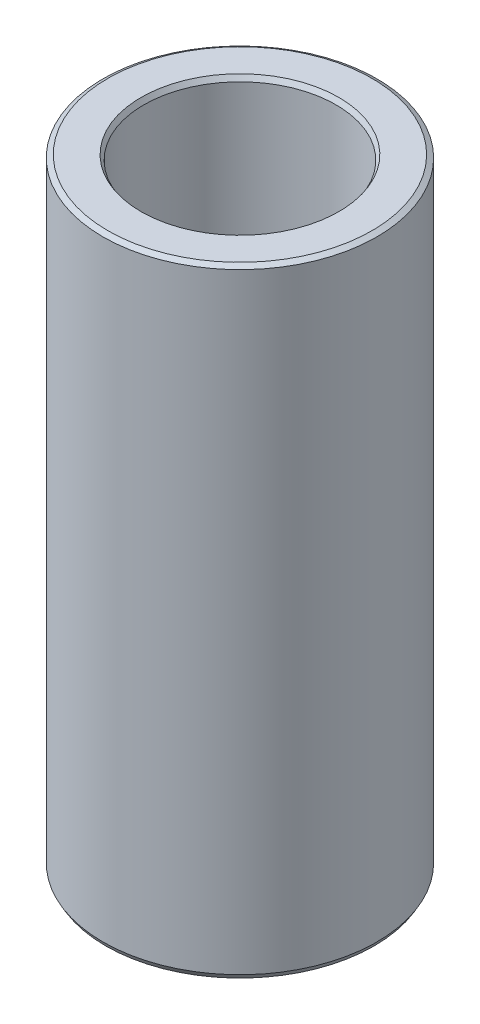
ISO-10303-21;
HEADER;
FILE_DESCRIPTION(('STEP AP214'),'2;1');
FILE_NAME('part.step','',(''),(''),'','','');
FILE_SCHEMA(('AUTOMOTIVE_DESIGN { 1 0 10303 214 1 1 1 1 }'));
ENDSEC;
DATA;
#1=APPLICATION_CONTEXT('core data for automotive mechanical design processes');
#2=APPLICATION_PROTOCOL_DEFINITION('international standard','automotive_design',2000,#1);
#3=PRODUCT_CONTEXT('',#1,'mechanical');
#4=PRODUCT('Part','Part','',(#3));
#5=PRODUCT_RELATED_PRODUCT_CATEGORY('part','',(#4));
#6=PRODUCT_DEFINITION_FORMATION('','',#4);
#7=PRODUCT_DEFINITION_CONTEXT('part definition',#1,'design');
#8=PRODUCT_DEFINITION('design','',#6,#7);
#9=PRODUCT_DEFINITION_SHAPE('','',#8);
#10=(LENGTH_UNIT() NAMED_UNIT(*) SI_UNIT(.MILLI.,.METRE.));
#11=(NAMED_UNIT(*) PLANE_ANGLE_UNIT() SI_UNIT($,.RADIAN.));
#12=(NAMED_UNIT(*) SI_UNIT($,.STERADIAN.) SOLID_ANGLE_UNIT());
#13=UNCERTAINTY_MEASURE_WITH_UNIT(LENGTH_MEASURE(1.E-05),#10,'distance_accuracy_value','');
#14=(GEOMETRIC_REPRESENTATION_CONTEXT(3) GLOBAL_UNCERTAINTY_ASSIGNED_CONTEXT((#13)) GLOBAL_UNIT_ASSIGNED_CONTEXT((#10,
#11,#12)) REPRESENTATION_CONTEXT('',''));
#15=CARTESIAN_POINT('',(0.,0.,0.));
#16=DIRECTION('',(0.,0.,1.));
#17=DIRECTION('',(1.,0.,0.));
#18=AXIS2_PLACEMENT_3D('',#15,#16,#17);
#19=CARTESIAN_POINT('',(0.,191.894333334505,0.));
#20=DIRECTION('',(0.,-1.,0.));
#21=DIRECTION('',(0.,0.,-1.));
#22=AXIS2_PLACEMENT_3D('',#19,#20,#21);
#23=CYLINDRICAL_SURFACE('',#22,42.5);
#24=CARTESIAN_POINT('',(0.,1.53416361331749,0.));
#25=DIRECTION('',(0.,1.,0.));
#26=DIRECTION('',(0.,0.,1.));
#27=AXIS2_PLACEMENT_3D('',#24,#25,#26);
#28=CIRCLE('',#27,42.5);
#29=CARTESIAN_POINT('',(0.,1.53416361331749,42.5));
#30=VERTEX_POINT('',#29);
#31=EDGE_CURVE('E10',#30,#30,#28,.T.);
#32=ORIENTED_EDGE('',*,*,#31,.T.);
#33=EDGE_LOOP('',(#32));
#34=FACE_BOUND('',#33,.T.);
#35=CARTESIAN_POINT('',(0.,191.008583559375,0.));
#36=DIRECTION('',(0.,1.,0.));
#37=DIRECTION('',(0.,0.,1.));
#38=AXIS2_PLACEMENT_3D('',#35,#36,#37);
#39=CIRCLE('',#38,42.5);
#40=CARTESIAN_POINT('',(0.,191.008583559375,42.5));
#41=VERTEX_POINT('',#40);
#42=EDGE_CURVE('E50',#41,#41,#39,.F.);
#43=ORIENTED_EDGE('',*,*,#42,.T.);
#44=EDGE_LOOP('',(#43));
#45=FACE_BOUND('',#44,.T.);
#46=ADVANCED_FACE('F39',(#34,#45),#23,.T.);
#47=CARTESIAN_POINT('',(0.,191.894333334505,0.));
#48=DIRECTION('',(0.,1.,0.));
#49=DIRECTION('',(0.,0.,1.));
#50=AXIS2_PLACEMENT_3D('',#47,#48,#49);
#51=PLANE('',#50);
#52=CARTESIAN_POINT('',(0.,191.894333334505,0.));
#53=DIRECTION('',(0.,1.,0.));
#54=DIRECTION('',(0.,0.,1.));
#55=AXIS2_PLACEMENT_3D('',#52,#53,#54);
#56=CIRCLE('',#55,30.7005157871693);
#57=CARTESIAN_POINT('',(0.,191.894333334505,30.7005157871693));
#58=VERTEX_POINT('',#57);
#59=EDGE_CURVE('E58',#58,#58,#56,.F.);
#60=ORIENTED_EDGE('',*,*,#59,.T.);
#61=EDGE_LOOP('',(#60));
#62=FACE_BOUND('',#61,.T.);
#63=CARTESIAN_POINT('',(0.,191.894333334505,0.));
#64=DIRECTION('',(0.,1.,0.));
#65=DIRECTION('',(0.,0.,1.));
#66=AXIS2_PLACEMENT_3D('',#63,#64,#65);
#67=CIRCLE('',#66,40.9658363866824);
#68=CARTESIAN_POINT('',(0.,191.894333334505,40.9658363866824));
#69=VERTEX_POINT('',#68);
#70=EDGE_CURVE('E61',#69,#69,#67,.T.);
#71=ORIENTED_EDGE('',*,*,#70,.T.);
#72=EDGE_LOOP('',(#71));
#73=FACE_BOUND('',#72,.T.);
#74=ADVANCED_FACE('F88',(#62,#73),#51,.T.);
#75=CARTESIAN_POINT('',(0.,0.,0.));
#76=DIRECTION('',(0.,1.,0.));
#77=DIRECTION('',(0.,0.,1.));
#78=AXIS2_PLACEMENT_3D('',#75,#76,#77);
#79=PLANE('',#78);
#80=CARTESIAN_POINT('',(0.,0.,0.));
#81=DIRECTION('',(0.,1.,0.));
#82=DIRECTION('',(0.,0.,1.));
#83=AXIS2_PLACEMENT_3D('',#80,#81,#82);
#84=CIRCLE('',#83,31.348929625357);
#85=CARTESIAN_POINT('',(0.,0.,31.348929625357));
#86=VERTEX_POINT('',#85);
#87=EDGE_CURVE('E51',#86,#86,#84,.T.);
#88=ORIENTED_EDGE('',*,*,#87,.T.);
#89=EDGE_LOOP('',(#88));
#90=FACE_BOUND('',#89,.T.);
#91=CARTESIAN_POINT('',(0.,0.,0.));
#92=DIRECTION('',(0.,1.,0.));
#93=DIRECTION('',(0.,0.,1.));
#94=AXIS2_PLACEMENT_3D('',#91,#92,#93);
#95=CIRCLE('',#94,41.6142502248702);
#96=CARTESIAN_POINT('',(0.,0.,41.6142502248702));
#97=VERTEX_POINT('',#96);
#98=EDGE_CURVE('E54',#97,#97,#95,.F.);
#99=ORIENTED_EDGE('',*,*,#98,.T.);
#100=EDGE_LOOP('',(#99));
#101=FACE_BOUND('',#100,.T.);
#102=ADVANCED_FACE('F83',(#90,#101),#79,.F.);
#103=CARTESIAN_POINT('',(0.,191.894333334505,0.));
#104=DIRECTION('',(0.,-1.,0.));
#105=DIRECTION('',(0.,0.,-1.));
#106=AXIS2_PLACEMENT_3D('',#103,#104,#105);
#107=CYLINDRICAL_SURFACE('',#106,29.8147660120395);
#108=CARTESIAN_POINT('',(0.,190.360169721187,0.));
#109=DIRECTION('',(0.,1.,0.));
#110=DIRECTION('',(0.,0.,1.));
#111=AXIS2_PLACEMENT_3D('',#108,#109,#110);
#112=CIRCLE('',#111,29.8147660120395);
#113=CARTESIAN_POINT('',(0.,190.360169721187,29.8147660120395));
#114=VERTEX_POINT('',#113);
#115=EDGE_CURVE('E67',#114,#114,#112,.T.);
#116=ORIENTED_EDGE('',*,*,#115,.T.);
#117=EDGE_LOOP('',(#116));
#118=FACE_BOUND('',#117,.T.);
#119=CARTESIAN_POINT('',(0.,0.885749775129813,0.));
#120=DIRECTION('',(0.,1.,0.));
#121=DIRECTION('',(0.,0.,1.));
#122=AXIS2_PLACEMENT_3D('',#119,#120,#121);
#123=CIRCLE('',#122,29.8147660120395);
#124=CARTESIAN_POINT('',(0.,0.885749775129813,29.8147660120395));
#125=VERTEX_POINT('',#124);
#126=EDGE_CURVE('E69',#125,#125,#123,.F.);
#127=ORIENTED_EDGE('',*,*,#126,.T.);
#128=EDGE_LOOP('',(#127));
#129=FACE_BOUND('',#128,.T.);
#130=ADVANCED_FACE('F71',(#118,#129),#107,.F.);
#131=CARTESIAN_POINT('',(0.,190.360169721187,0.));
#132=DIRECTION('',(0.,1.,0.));
#133=DIRECTION('',(0.,0.,1.));
#134=AXIS2_PLACEMENT_3D('',#131,#132,#133);
#135=CONICAL_SURFACE('',#134,29.8147660120395,0.523598775598297);
#136=ORIENTED_EDGE('',*,*,#59,.F.);
#137=EDGE_LOOP('',(#136));
#138=FACE_BOUND('',#137,.T.);
#139=ORIENTED_EDGE('',*,*,#115,.F.);
#140=EDGE_LOOP('',(#139));
#141=FACE_BOUND('',#140,.T.);
#142=ADVANCED_FACE('F77',(#138,#141),#135,.F.);
#143=CARTESIAN_POINT('',(0.,0.,0.));
#144=DIRECTION('',(0.,-1.,0.));
#145=DIRECTION('',(0.,0.,-1.));
#146=AXIS2_PLACEMENT_3D('',#143,#144,#145);
#147=CONICAL_SURFACE('',#146,31.348929625357,1.0471975511966);
#148=ORIENTED_EDGE('',*,*,#126,.F.);
#149=EDGE_LOOP('',(#148));
#150=FACE_BOUND('',#149,.T.);
#151=ORIENTED_EDGE('',*,*,#87,.F.);
#152=EDGE_LOOP('',(#151));
#153=FACE_BOUND('',#152,.T.);
#154=ADVANCED_FACE('F73',(#150,#153),#147,.F.);
#155=CARTESIAN_POINT('',(0.,1.53416361331749,0.));
#156=DIRECTION('',(0.,1.,0.));
#157=DIRECTION('',(0.,0.,1.));
#158=AXIS2_PLACEMENT_3D('',#155,#156,#157);
#159=CONICAL_SURFACE('',#158,42.5,0.523598775598295);
#160=CARTESIAN_POINT('',(0.,0.,41.6142502248702));
#161=CARTESIAN_POINT('',(0.,0.015980870972057,41.6234767850278));
#162=CARTESIAN_POINT('',(0.,0.0319617419441141,41.6327033451854));
#163=CARTESIAN_POINT('',(0.,0.0639234838882283,41.6511564655006));
#164=CARTESIAN_POINT('',(0.,0.0799043548602855,41.6603830256582));
#165=CARTESIAN_POINT('',(0.,0.1118660968044,41.6788361459734));
#166=CARTESIAN_POINT('',(0.,0.127846967776457,41.6880627061311));
#167=CARTESIAN_POINT('',(0.,0.159808709720571,41.7065158264463));
#168=CARTESIAN_POINT('',(0.,0.175789580692628,41.7157423866039));
#169=CARTESIAN_POINT('',(0.,0.207751322636743,41.7341955069191));
#170=CARTESIAN_POINT('',(0.,0.2237321936088,41.7434220670767));
#171=CARTESIAN_POINT('',(0.,0.255693935552914,41.7618751873919));
#172=CARTESIAN_POINT('',(0.,0.271674806524971,41.7711017475495));
#173=CARTESIAN_POINT('',(0.,0.303636548469085,41.7895548678647));
#174=CARTESIAN_POINT('',(0.,0.319617419441142,41.7987814280223));
#175=CARTESIAN_POINT('',(0.,0.351579161385256,41.8172345483375));
#176=CARTESIAN_POINT('',(0.,0.367560032357314,41.8264611084951));
#177=CARTESIAN_POINT('',(0.,0.399521774301429,41.8449142288103));
#178=CARTESIAN_POINT('',(0.,0.415502645273486,41.8541407889679));
#179=CARTESIAN_POINT('',(0.,0.447464387217599,41.8725939092831));
#180=CARTESIAN_POINT('',(0.,0.463445258189657,41.8818204694407));
#181=CARTESIAN_POINT('',(0.,0.495407000133771,41.9002735897559));
#182=CARTESIAN_POINT('',(0.,0.511387871105828,41.9095001499135));
#183=CARTESIAN_POINT('',(0.,0.543349613049942,41.9279532702287));
#184=CARTESIAN_POINT('',(0.,0.559330484022,41.9371798303863));
#185=CARTESIAN_POINT('',(0.,0.591292225966114,41.9556329507015));
#186=CARTESIAN_POINT('',(0.,0.607273096938171,41.9648595108591));
#187=CARTESIAN_POINT('',(0.,0.639234838882285,41.9833126311743));
#188=CARTESIAN_POINT('',(0.,0.655215709854343,41.9925391913319));
#189=CARTESIAN_POINT('',(0.,0.687177451798457,42.0109923116471));
#190=CARTESIAN_POINT('',(0.,0.703158322770514,42.0202188718047));
#191=CARTESIAN_POINT('',(0.,0.735120064714628,42.0386719921199));
#192=CARTESIAN_POINT('',(0.,0.751100935686685,42.0478985522775));
#193=CARTESIAN_POINT('',(0.,0.7830626776308,42.0663516725927));
#194=CARTESIAN_POINT('',(0.,0.799043548602857,42.0755782327503));
#195=CARTESIAN_POINT('',(0.,0.831005290546971,42.0940313530655));
#196=CARTESIAN_POINT('',(0.,0.846986161519028,42.1032579132231));
#197=CARTESIAN_POINT('',(0.,0.878947903463142,42.1217110335383));
#198=CARTESIAN_POINT('',(0.,0.8949287744352,42.1309375936959));
#199=CARTESIAN_POINT('',(0.,0.926890516379314,42.1493907140111));
#200=CARTESIAN_POINT('',(0.,0.942871387351371,42.1586172741687));
#201=CARTESIAN_POINT('',(0.,0.974833129295485,42.1770703944839));
#202=CARTESIAN_POINT('',(0.,0.990814000267543,42.1862969546415));
#203=CARTESIAN_POINT('',(0.,1.02277574221166,42.2047500749568));
#204=CARTESIAN_POINT('',(0.,1.03875661318371,42.2139766351144));
#205=CARTESIAN_POINT('',(0.,1.07071835512783,42.2324297554296));
#206=CARTESIAN_POINT('',(0.,1.08669922609989,42.2416563155872));
#207=CARTESIAN_POINT('',(0.,1.118660968044,42.2601094359024));
#208=CARTESIAN_POINT('',(0.,1.13464183901606,42.26933599606));
#209=CARTESIAN_POINT('',(0.,1.16660358096017,42.2877891163752));
#210=CARTESIAN_POINT('',(0.,1.18258445193223,42.2970156765328));
#211=CARTESIAN_POINT('',(0.,1.21454619387634,42.315468796848));
#212=CARTESIAN_POINT('',(0.,1.2305270648484,42.3246953570056));
#213=CARTESIAN_POINT('',(0.,1.26248880679251,42.3431484773208));
#214=CARTESIAN_POINT('',(0.,1.27846967776457,42.3523750374784));
#215=CARTESIAN_POINT('',(0.,1.31043141970869,42.3708281577936));
#216=CARTESIAN_POINT('',(0.,1.32641229068074,42.3800547179512));
#217=CARTESIAN_POINT('',(0.,1.35837403262486,42.3985078382664));
#218=CARTESIAN_POINT('',(0.,1.37435490359691,42.407734398424));
#219=CARTESIAN_POINT('',(0.,1.40631664554103,42.4261875187392));
#220=CARTESIAN_POINT('',(0.,1.42229751651309,42.4354140788968));
#221=CARTESIAN_POINT('',(0.,1.4542592584572,42.453867199212));
#222=CARTESIAN_POINT('',(0.,1.47024012942926,42.4630937593696));
#223=CARTESIAN_POINT('',(0.,1.50220187137337,42.4815468796848));
#224=CARTESIAN_POINT('',(0.,1.51818274234543,42.4907734398424));
#225=CARTESIAN_POINT('',(0.,1.53416361331749,42.5));
#226=B_SPLINE_CURVE_WITH_KNOTS('',3,(#160,#161,#162,#163,#164,#165,#166,#167,#168,#169,#170,
#171,#172,#173,#174,#175,#176,#177,#178,#179,#180,#181,#182,#183,#184,#185,#186,#187,#188,#189,
#190,#191,#192,#193,#194,#195,#196,#197,#198,#199,#200,#201,#202,#203,#204,#205,#206,#207,#208,
#209,#210,#211,#212,#213,#214,#215,#216,#217,#218,#219,#220,#221,#222,#223,#224,#225),
.UNSPECIFIED.,.F.,.F.,(4,2,2,2,2,2,2,2,2,2,2,2,2,2,2,2,2,2,2,2,2,2,2,2,2,2,2,2,2,2,2,2,4),(0.,
0.0553593609456113,0.110718721891223,0.166078082836834,0.221437443782445,0.276796804728056,
0.332156165673668,0.387515526619279,0.442874887564887,0.498234248510498,0.553593609456109,
0.60895297040172,0.664312331347332,0.719671692292943,0.775031053238554,0.830390414184166,
0.885749775129777,0.941109136075388,0.996468497020999,1.05182785796661,1.10718721891222,
1.16254657985783,1.21790594080344,1.27326530174906,1.32862466269467,1.38398402364028,
1.43934338458589,1.4947027455315,1.55006210647711,1.60542146742272,1.66078082836833,
1.71614018931394,1.77149955025955),.UNSPECIFIED.);
#227=EDGE_CURVE('BSEAM76',#97,#30,#226,.T.);
#228=ORIENTED_EDGE('',*,*,#98,.F.);
#229=ORIENTED_EDGE('',*,*,#31,.F.);
#230=ORIENTED_EDGE('',*,*,#227,.T.);
#231=ORIENTED_EDGE('',*,*,#227,.F.);
#232=EDGE_LOOP('',(#228,#230,#229,#231));
#233=FACE_BOUND('',#232,.T.);
#234=ADVANCED_FACE('F76',(#233),#159,.T.);
#235=CARTESIAN_POINT('',(0.,191.894333334505,0.));
#236=DIRECTION('',(0.,-1.,0.));
#237=DIRECTION('',(0.,0.,-1.));
#238=AXIS2_PLACEMENT_3D('',#235,#236,#237);
#239=CONICAL_SURFACE('',#238,40.9658363866824,1.04719755119659);
#240=ORIENTED_EDGE('',*,*,#42,.F.);
#241=EDGE_LOOP('',(#240));
#242=FACE_BOUND('',#241,.T.);
#243=ORIENTED_EDGE('',*,*,#70,.F.);
#244=EDGE_LOOP('',(#243));
#245=FACE_BOUND('',#244,.T.);
#246=ADVANCED_FACE('F45',(#242,#245),#239,.T.);
#247=CLOSED_SHELL('',(#46,#74,#102,#130,#142,#154,#234,#246));
#248=MANIFOLD_SOLID_BREP('B2',#247);
#249=ADVANCED_BREP_SHAPE_REPRESENTATION('',(#18,#248),#14);
#250=SHAPE_DEFINITION_REPRESENTATION(#9,#249);
ENDSEC;
END-ISO-10303-21;
